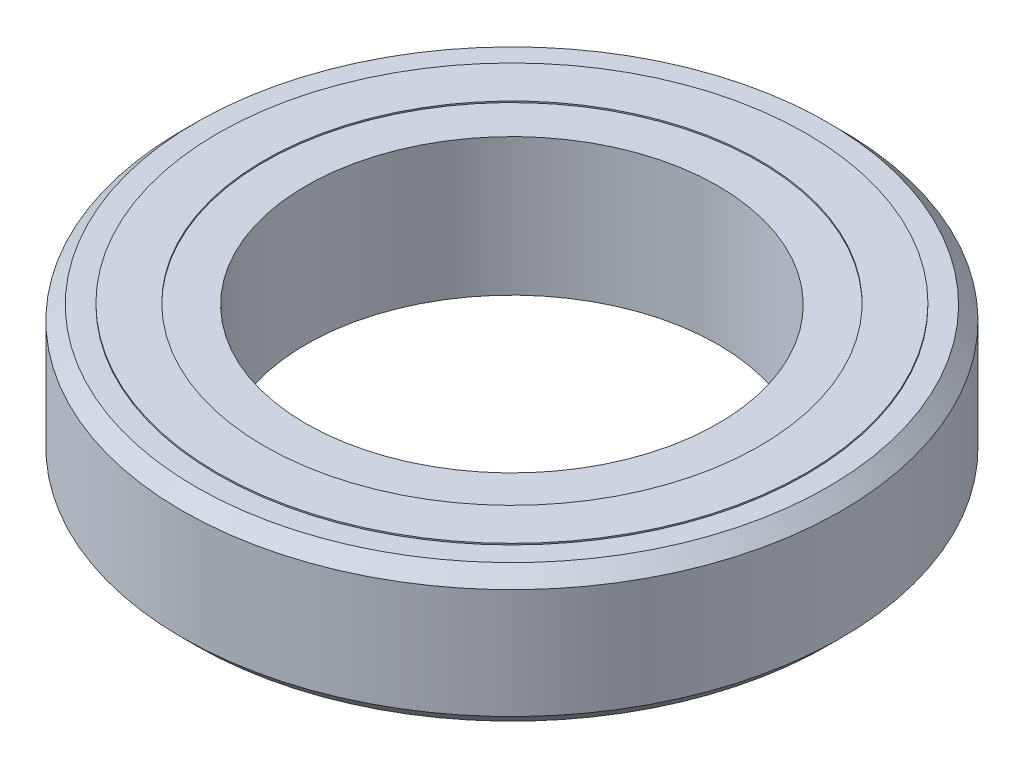
ISO-10303-21;
HEADER;
FILE_DESCRIPTION(('STEP AP214'),'2;1');
FILE_NAME('part.step','',(''),(''),'','','');
FILE_SCHEMA(('AUTOMOTIVE_DESIGN { 1 0 10303 214 1 1 1 1 }'));
ENDSEC;
DATA;
#1=APPLICATION_CONTEXT('core data for automotive mechanical design processes');
#2=APPLICATION_PROTOCOL_DEFINITION('international standard','automotive_design',2000,#1);
#3=PRODUCT_CONTEXT('',#1,'mechanical');
#4=PRODUCT('Part','Part','',(#3));
#5=PRODUCT_RELATED_PRODUCT_CATEGORY('part','',(#4));
#6=PRODUCT_DEFINITION_FORMATION('','',#4);
#7=PRODUCT_DEFINITION_CONTEXT('part definition',#1,'design');
#8=PRODUCT_DEFINITION('design','',#6,#7);
#9=PRODUCT_DEFINITION_SHAPE('','',#8);
#10=(LENGTH_UNIT() NAMED_UNIT(*) SI_UNIT(.MILLI.,.METRE.));
#11=(NAMED_UNIT(*) PLANE_ANGLE_UNIT() SI_UNIT($,.RADIAN.));
#12=(NAMED_UNIT(*) SI_UNIT($,.STERADIAN.) SOLID_ANGLE_UNIT());
#13=UNCERTAINTY_MEASURE_WITH_UNIT(LENGTH_MEASURE(1.E-05),#10,'distance_accuracy_value','');
#14=(GEOMETRIC_REPRESENTATION_CONTEXT(3) GLOBAL_UNCERTAINTY_ASSIGNED_CONTEXT((#13)) GLOBAL_UNIT_ASSIGNED_CONTEXT((#10,
#11,#12)) REPRESENTATION_CONTEXT('',''));
#15=CARTESIAN_POINT('',(0.,0.,0.));
#16=DIRECTION('',(0.,0.,1.));
#17=DIRECTION('',(1.,0.,0.));
#18=AXIS2_PLACEMENT_3D('',#15,#16,#17);
#19=CARTESIAN_POINT('',(0.,2.5,0.));
#20=DIRECTION('',(0.,1.,0.));
#21=DIRECTION('',(0.,0.,1.));
#22=AXIS2_PLACEMENT_3D('',#19,#20,#21);
#23=PLANE('',#22);
#24=CARTESIAN_POINT('',(0.,2.5,0.));
#25=DIRECTION('',(0.,1.,0.));
#26=DIRECTION('',(0.,0.,1.));
#27=AXIS2_PLACEMENT_3D('',#24,#25,#26);
#28=CIRCLE('',#27,10.7113374815966);
#29=CARTESIAN_POINT('',(0.,2.5,10.7113374815966));
#30=VERTEX_POINT('',#29);
#31=EDGE_CURVE('E49',#30,#30,#28,.F.);
#32=ORIENTED_EDGE('',*,*,#31,.T.);
#33=EDGE_LOOP('',(#32));
#34=FACE_BOUND('',#33,.T.);
#35=CARTESIAN_POINT('',(0.,2.5,0.));
#36=DIRECTION('',(0.,1.,0.));
#37=DIRECTION('',(0.,0.,1.));
#38=AXIS2_PLACEMENT_3D('',#35,#36,#37);
#39=CIRCLE('',#38,11.5);
#40=CARTESIAN_POINT('',(0.,2.5,11.5));
#41=VERTEX_POINT('',#40);
#42=EDGE_CURVE('E44',#41,#41,#39,.T.);
#43=ORIENTED_EDGE('',*,*,#42,.T.);
#44=EDGE_LOOP('',(#43));
#45=FACE_BOUND('',#44,.T.);
#46=ADVANCED_FACE('F32',(#34,#45),#23,.T.);
#47=CARTESIAN_POINT('',(0.,-2.5,0.));
#48=DIRECTION('',(0.,1.,0.));
#49=DIRECTION('',(0.,0.,1.));
#50=AXIS2_PLACEMENT_3D('',#47,#48,#49);
#51=PLANE('',#50);
#52=CARTESIAN_POINT('',(0.,-2.5,0.));
#53=DIRECTION('',(0.,1.,0.));
#54=DIRECTION('',(0.,0.,1.));
#55=AXIS2_PLACEMENT_3D('',#52,#53,#54);
#56=CIRCLE('',#55,10.7113374815966);
#57=CARTESIAN_POINT('',(0.,-2.5,10.7113374815966));
#58=VERTEX_POINT('',#57);
#59=EDGE_CURVE('E36',#58,#58,#56,.F.);
#60=ORIENTED_EDGE('',*,*,#59,.F.);
#61=EDGE_LOOP('',(#60));
#62=FACE_BOUND('',#61,.T.);
#63=CARTESIAN_POINT('',(0.,-2.5,0.));
#64=DIRECTION('',(0.,1.,0.));
#65=DIRECTION('',(0.,0.,1.));
#66=AXIS2_PLACEMENT_3D('',#63,#64,#65);
#67=CIRCLE('',#66,11.5);
#68=CARTESIAN_POINT('',(0.,-2.5,11.5));
#69=VERTEX_POINT('',#68);
#70=EDGE_CURVE('E65',#69,#69,#67,.F.);
#71=ORIENTED_EDGE('',*,*,#70,.T.);
#72=EDGE_LOOP('',(#71));
#73=FACE_BOUND('',#72,.T.);
#74=ADVANCED_FACE('F104',(#62,#73),#51,.F.);
#75=CARTESIAN_POINT('',(0.,2.5,0.));
#76=DIRECTION('',(0.,-1.,0.));
#77=DIRECTION('',(0.,0.,-1.));
#78=AXIS2_PLACEMENT_3D('',#75,#76,#77);
#79=CYLINDRICAL_SURFACE('',#78,12.);
#80=CARTESIAN_POINT('',(0.,-2.,0.));
#81=DIRECTION('',(0.,1.,0.));
#82=DIRECTION('',(0.,0.,1.));
#83=AXIS2_PLACEMENT_3D('',#80,#81,#82);
#84=CIRCLE('',#83,12.);
#85=CARTESIAN_POINT('',(0.,-2.,12.));
#86=VERTEX_POINT('',#85);
#87=EDGE_CURVE('E62',#86,#86,#84,.T.);
#88=ORIENTED_EDGE('',*,*,#87,.T.);
#89=EDGE_LOOP('',(#88));
#90=FACE_BOUND('',#89,.T.);
#91=CARTESIAN_POINT('',(0.,2.,0.));
#92=DIRECTION('',(0.,1.,0.));
#93=DIRECTION('',(0.,0.,1.));
#94=AXIS2_PLACEMENT_3D('',#91,#92,#93);
#95=CIRCLE('',#94,12.);
#96=CARTESIAN_POINT('',(0.,2.,12.));
#97=VERTEX_POINT('',#96);
#98=EDGE_CURVE('E57',#97,#97,#95,.F.);
#99=ORIENTED_EDGE('',*,*,#98,.T.);
#100=EDGE_LOOP('',(#99));
#101=FACE_BOUND('',#100,.T.);
#102=ADVANCED_FACE('F111',(#90,#101),#79,.T.);
#103=CARTESIAN_POINT('',(0.,-2.,0.));
#104=DIRECTION('',(0.,1.,0.));
#105=DIRECTION('',(0.,0.,1.));
#106=AXIS2_PLACEMENT_3D('',#103,#104,#105);
#107=CONICAL_SURFACE('',#106,12.,0.78539816339745);
#108=ORIENTED_EDGE('',*,*,#70,.F.);
#109=EDGE_LOOP('',(#108));
#110=FACE_BOUND('',#109,.T.);
#111=ORIENTED_EDGE('',*,*,#87,.F.);
#112=EDGE_LOOP('',(#111));
#113=FACE_BOUND('',#112,.T.);
#114=ADVANCED_FACE('F135',(#110,#113),#107,.T.);
#115=CARTESIAN_POINT('',(0.,2.5,0.));
#116=DIRECTION('',(0.,-1.,0.));
#117=DIRECTION('',(0.,0.,-1.));
#118=AXIS2_PLACEMENT_3D('',#115,#116,#117);
#119=CONICAL_SURFACE('',#118,11.5,0.785398163397447);
#120=ORIENTED_EDGE('',*,*,#98,.F.);
#121=EDGE_LOOP('',(#120));
#122=FACE_BOUND('',#121,.T.);
#123=ORIENTED_EDGE('',*,*,#42,.F.);
#124=EDGE_LOOP('',(#123));
#125=FACE_BOUND('',#124,.T.);
#126=ADVANCED_FACE('F34',(#122,#125),#119,.T.);
#127=CARTESIAN_POINT('',(0.,2.55,0.));
#128=DIRECTION('',(0.,-1.,0.));
#129=DIRECTION('',(0.,0.,-1.));
#130=AXIS2_PLACEMENT_3D('',#127,#128,#129);
#131=CYLINDRICAL_SURFACE('',#130,10.7113374815966);
#132=CARTESIAN_POINT('',(0.,-2.55,0.));
#133=DIRECTION('',(0.,1.,0.));
#134=DIRECTION('',(0.,0.,1.));
#135=AXIS2_PLACEMENT_3D('',#132,#133,#134);
#136=CIRCLE('',#135,10.7113374815966);
#137=CARTESIAN_POINT('',(0.,-2.55,10.7113374815966));
#138=VERTEX_POINT('',#137);
#139=EDGE_CURVE('E47',#138,#138,#136,.T.);
#140=ORIENTED_EDGE('',*,*,#139,.T.);
#141=EDGE_LOOP('',(#140));
#142=FACE_BOUND('',#141,.T.);
#143=ORIENTED_EDGE('',*,*,#59,.T.);
#144=EDGE_LOOP('',(#143));
#145=FACE_BOUND('',#144,.T.);
#146=ADVANCED_FACE('F98',(#142,#145),#131,.T.);
#147=CARTESIAN_POINT('',(0.,-2.55,0.));
#148=DIRECTION('',(0.,1.,0.));
#149=DIRECTION('',(0.,0.,1.));
#150=AXIS2_PLACEMENT_3D('',#147,#148,#149);
#151=PLANE('',#150);
#152=ORIENTED_EDGE('',*,*,#139,.F.);
#153=EDGE_LOOP('',(#152));
#154=FACE_BOUND('',#153,.T.);
#155=CARTESIAN_POINT('',(0.,-2.55,0.));
#156=DIRECTION('',(0.,1.,0.));
#157=DIRECTION('',(0.,0.,1.));
#158=AXIS2_PLACEMENT_3D('',#155,#156,#157);
#159=CIRCLE('',#158,9.01636272883);
#160=CARTESIAN_POINT('',(0.,-2.55,9.01636272883));
#161=VERTEX_POINT('',#160);
#162=EDGE_CURVE('E79',#161,#161,#159,.T.);
#163=ORIENTED_EDGE('',*,*,#162,.T.);
#164=EDGE_LOOP('',(#163));
#165=FACE_BOUND('',#164,.T.);
#166=ADVANCED_FACE('F99',(#154,#165),#151,.F.);
#167=CARTESIAN_POINT('',(0.,2.55,0.));
#168=DIRECTION('',(0.,-1.,0.));
#169=DIRECTION('',(0.,0.,-1.));
#170=AXIS2_PLACEMENT_3D('',#167,#168,#169);
#171=CYLINDRICAL_SURFACE('',#170,9.01636272883);
#172=ORIENTED_EDGE('',*,*,#162,.F.);
#173=EDGE_LOOP('',(#172));
#174=FACE_BOUND('',#173,.T.);
#175=CARTESIAN_POINT('',(0.,-2.5,0.));
#176=DIRECTION('',(0.,1.,0.));
#177=DIRECTION('',(0.,0.,1.));
#178=AXIS2_PLACEMENT_3D('',#175,#176,#177);
#179=CIRCLE('',#178,9.01636272883);
#180=CARTESIAN_POINT('',(0.,-2.5,9.01636272883));
#181=VERTEX_POINT('',#180);
#182=EDGE_CURVE('E53',#181,#181,#179,.F.);
#183=ORIENTED_EDGE('',*,*,#182,.F.);
#184=EDGE_LOOP('',(#183));
#185=FACE_BOUND('',#184,.T.);
#186=ADVANCED_FACE('F90',(#174,#185),#171,.F.);
#187=CARTESIAN_POINT('',(0.,2.55,0.));
#188=DIRECTION('',(0.,1.,0.));
#189=DIRECTION('',(0.,0.,1.));
#190=AXIS2_PLACEMENT_3D('',#187,#188,#189);
#191=PLANE('',#190);
#192=CARTESIAN_POINT('',(0.,2.55,0.));
#193=DIRECTION('',(0.,1.,0.));
#194=DIRECTION('',(0.,0.,1.));
#195=AXIS2_PLACEMENT_3D('',#192,#193,#194);
#196=CIRCLE('',#195,10.7113374815966);
#197=CARTESIAN_POINT('',(0.,2.55,10.7113374815966));
#198=VERTEX_POINT('',#197);
#199=EDGE_CURVE('E70',#198,#198,#196,.T.);
#200=ORIENTED_EDGE('',*,*,#199,.T.);
#201=EDGE_LOOP('',(#200));
#202=FACE_BOUND('',#201,.T.);
#203=CARTESIAN_POINT('',(0.,2.55,0.));
#204=DIRECTION('',(0.,1.,0.));
#205=DIRECTION('',(0.,0.,1.));
#206=AXIS2_PLACEMENT_3D('',#203,#204,#205);
#207=CIRCLE('',#206,9.01636272883);
#208=CARTESIAN_POINT('',(0.,2.55,9.01636272883));
#209=VERTEX_POINT('',#208);
#210=EDGE_CURVE('E77',#209,#209,#207,.T.);
#211=ORIENTED_EDGE('',*,*,#210,.F.);
#212=EDGE_LOOP('',(#211));
#213=FACE_BOUND('',#212,.T.);
#214=ADVANCED_FACE('F87',(#202,#213),#191,.T.);
#215=ORIENTED_EDGE('',*,*,#31,.F.);
#216=EDGE_LOOP('',(#215));
#217=FACE_BOUND('',#216,.T.);
#218=ORIENTED_EDGE('',*,*,#199,.F.);
#219=EDGE_LOOP('',(#218));
#220=FACE_BOUND('',#219,.T.);
#221=ADVANCED_FACE('F89',(#217,#220),#131,.T.);
#222=CARTESIAN_POINT('',(0.,2.5,0.));
#223=DIRECTION('',(0.,1.,0.));
#224=DIRECTION('',(0.,0.,1.));
#225=AXIS2_PLACEMENT_3D('',#222,#223,#224);
#226=CIRCLE('',#225,9.01636272883);
#227=CARTESIAN_POINT('',(0.,2.5,9.01636272883));
#228=VERTEX_POINT('',#227);
#229=EDGE_CURVE('E10',#228,#228,#226,.F.);
#230=ORIENTED_EDGE('',*,*,#229,.T.);
#231=EDGE_LOOP('',(#230));
#232=FACE_BOUND('',#231,.T.);
#233=ORIENTED_EDGE('',*,*,#210,.T.);
#234=EDGE_LOOP('',(#233));
#235=FACE_BOUND('',#234,.T.);
#236=ADVANCED_FACE('F85',(#232,#235),#171,.F.);
#237=CARTESIAN_POINT('',(0.,2.5,0.));
#238=DIRECTION('',(0.,1.,0.));
#239=DIRECTION('',(0.,0.,1.));
#240=AXIS2_PLACEMENT_3D('',#237,#238,#239);
#241=CIRCLE('',#240,7.5);
#242=CARTESIAN_POINT('',(0.,2.5,7.5));
#243=VERTEX_POINT('',#242);
#244=EDGE_CURVE('E54',#243,#243,#241,.T.);
#245=ORIENTED_EDGE('',*,*,#244,.F.);
#246=EDGE_LOOP('',(#245));
#247=FACE_BOUND('',#246,.T.);
#248=ORIENTED_EDGE('',*,*,#229,.F.);
#249=EDGE_LOOP('',(#248));
#250=FACE_BOUND('',#249,.T.);
#251=ADVANCED_FACE('F107',(#247,#250),#23,.T.);
#252=CARTESIAN_POINT('',(0.,2.5,0.));
#253=DIRECTION('',(0.,-1.,0.));
#254=DIRECTION('',(0.,0.,-1.));
#255=AXIS2_PLACEMENT_3D('',#252,#253,#254);
#256=CYLINDRICAL_SURFACE('',#255,7.5);
#257=ORIENTED_EDGE('',*,*,#244,.T.);
#258=EDGE_LOOP('',(#257));
#259=FACE_BOUND('',#258,.T.);
#260=CARTESIAN_POINT('',(0.,-2.5,0.));
#261=DIRECTION('',(0.,1.,0.));
#262=DIRECTION('',(0.,0.,1.));
#263=AXIS2_PLACEMENT_3D('',#260,#261,#262);
#264=CIRCLE('',#263,7.5);
#265=CARTESIAN_POINT('',(0.,-2.5,7.5));
#266=VERTEX_POINT('',#265);
#267=EDGE_CURVE('E52',#266,#266,#264,.T.);
#268=ORIENTED_EDGE('',*,*,#267,.F.);
#269=EDGE_LOOP('',(#268));
#270=FACE_BOUND('',#269,.T.);
#271=ADVANCED_FACE('F118',(#259,#270),#256,.F.);
#272=ORIENTED_EDGE('',*,*,#267,.T.);
#273=EDGE_LOOP('',(#272));
#274=FACE_BOUND('',#273,.T.);
#275=ORIENTED_EDGE('',*,*,#182,.T.);
#276=EDGE_LOOP('',(#275));
#277=FACE_BOUND('',#276,.T.);
#278=ADVANCED_FACE('F114',(#274,#277),#51,.F.);
#279=CLOSED_SHELL('',(#46,#74,#102,#114,#126,#146,#166,#186,#214,#221,#236,#251,#271,#278));
#280=MANIFOLD_SOLID_BREP('B2',#279);
#281=ADVANCED_BREP_SHAPE_REPRESENTATION('',(#18,#280),#14);
#282=SHAPE_DEFINITION_REPRESENTATION(#9,#281);
ENDSEC;
END-ISO-10303-21;
